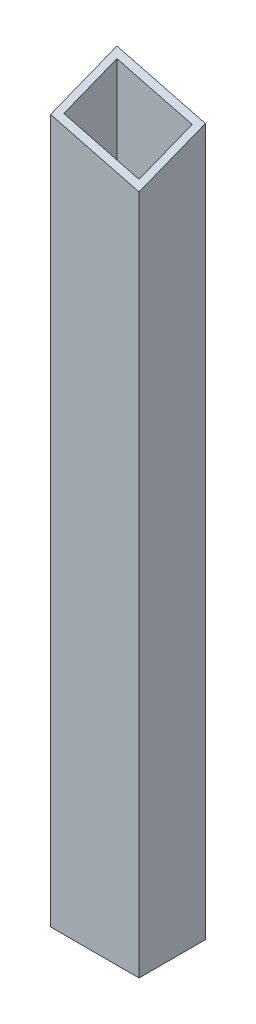
ISO-10303-21;
HEADER;
FILE_DESCRIPTION(('STEP AP214'),'2;1');
FILE_NAME('part.step','',(''),(''),'','','');
FILE_SCHEMA(('AUTOMOTIVE_DESIGN { 1 0 10303 214 1 1 1 1 }'));
ENDSEC;
DATA;
#1=APPLICATION_CONTEXT('core data for automotive mechanical design processes');
#2=APPLICATION_PROTOCOL_DEFINITION('international standard','automotive_design',2000,#1);
#3=PRODUCT_CONTEXT('',#1,'mechanical');
#4=PRODUCT('Part','Part','',(#3));
#5=PRODUCT_RELATED_PRODUCT_CATEGORY('part','',(#4));
#6=PRODUCT_DEFINITION_FORMATION('','',#4);
#7=PRODUCT_DEFINITION_CONTEXT('part definition',#1,'design');
#8=PRODUCT_DEFINITION('design','',#6,#7);
#9=PRODUCT_DEFINITION_SHAPE('','',#8);
#10=(LENGTH_UNIT() NAMED_UNIT(*) SI_UNIT(.MILLI.,.METRE.));
#11=(NAMED_UNIT(*) PLANE_ANGLE_UNIT() SI_UNIT($,.RADIAN.));
#12=(NAMED_UNIT(*) SI_UNIT($,.STERADIAN.) SOLID_ANGLE_UNIT());
#13=UNCERTAINTY_MEASURE_WITH_UNIT(LENGTH_MEASURE(1.E-05),#10,'distance_accuracy_value','');
#14=(GEOMETRIC_REPRESENTATION_CONTEXT(3) GLOBAL_UNCERTAINTY_ASSIGNED_CONTEXT((#13)) GLOBAL_UNIT_ASSIGNED_CONTEXT((#10,
#11,#12)) REPRESENTATION_CONTEXT('',''));
#15=CARTESIAN_POINT('',(0.,0.,0.));
#16=DIRECTION('',(0.,0.,1.));
#17=DIRECTION('',(1.,0.,0.));
#18=AXIS2_PLACEMENT_3D('',#15,#16,#17);
#19=CARTESIAN_POINT('',(0.,0.,0.));
#20=DIRECTION('',(0.,1.,0.));
#21=DIRECTION('',(0.,0.,1.));
#22=AXIS2_PLACEMENT_3D('',#19,#20,#21);
#23=PLANE('',#22);
#24=DIRECTION('',(0.,0.,1.));
#25=VECTOR('',#24,1.);
#26=CARTESIAN_POINT('',(-20.,0.,-15.));
#27=LINE('',#26,#25);
#28=CARTESIAN_POINT('',(-20.,0.,-15.));
#29=VERTEX_POINT('',#28);
#30=CARTESIAN_POINT('',(-20.,0.,15.));
#31=VERTEX_POINT('',#30);
#32=EDGE_CURVE('E156',#29,#31,#27,.T.);
#33=ORIENTED_EDGE('',*,*,#32,.F.);
#34=DIRECTION('',(-1.,0.,0.));
#35=VECTOR('',#34,1.);
#36=CARTESIAN_POINT('',(20.,0.,-15.));
#37=LINE('',#36,#35);
#38=CARTESIAN_POINT('',(20.,0.,-15.));
#39=VERTEX_POINT('',#38);
#40=EDGE_CURVE('E148',#39,#29,#37,.T.);
#41=ORIENTED_EDGE('',*,*,#40,.F.);
#42=DIRECTION('',(0.,0.,-1.));
#43=VECTOR('',#42,1.);
#44=CARTESIAN_POINT('',(20.,0.,-15.));
#45=LINE('',#44,#43);
#46=CARTESIAN_POINT('',(20.,0.,15.));
#47=VERTEX_POINT('',#46);
#48=EDGE_CURVE('E145',#47,#39,#45,.T.);
#49=ORIENTED_EDGE('',*,*,#48,.F.);
#50=DIRECTION('',(1.,0.,0.));
#51=VECTOR('',#50,1.);
#52=CARTESIAN_POINT('',(20.,0.,15.));
#53=LINE('',#52,#51);
#54=EDGE_CURVE('E153',#31,#47,#53,.T.);
#55=ORIENTED_EDGE('',*,*,#54,.F.);
#56=EDGE_LOOP('',(#33,#41,#49,#55));
#57=FACE_BOUND('',#56,.T.);
#58=DIRECTION('',(0.,0.,1.));
#59=VECTOR('',#58,1.);
#60=CARTESIAN_POINT('',(-17.,0.,0.));
#61=LINE('',#60,#59);
#62=CARTESIAN_POINT('',(-17.,0.,-12.));
#63=VERTEX_POINT('',#62);
#64=CARTESIAN_POINT('',(-17.,0.,12.));
#65=VERTEX_POINT('',#64);
#66=EDGE_CURVE('E175',#63,#65,#61,.T.);
#67=ORIENTED_EDGE('',*,*,#66,.T.);
#68=DIRECTION('',(1.,0.,0.));
#69=VECTOR('',#68,1.);
#70=CARTESIAN_POINT('',(0.,0.,12.));
#71=LINE('',#70,#69);
#72=CARTESIAN_POINT('',(17.,0.,12.));
#73=VERTEX_POINT('',#72);
#74=EDGE_CURVE('E172',#65,#73,#71,.T.);
#75=ORIENTED_EDGE('',*,*,#74,.T.);
#76=DIRECTION('',(0.,0.,-1.));
#77=VECTOR('',#76,1.);
#78=CARTESIAN_POINT('',(17.,0.,0.));
#79=LINE('',#78,#77);
#80=CARTESIAN_POINT('',(17.,0.,-12.));
#81=VERTEX_POINT('',#80);
#82=EDGE_CURVE('E169',#73,#81,#79,.T.);
#83=ORIENTED_EDGE('',*,*,#82,.T.);
#84=DIRECTION('',(-1.,0.,0.));
#85=VECTOR('',#84,1.);
#86=CARTESIAN_POINT('',(0.,0.,-12.));
#87=LINE('',#86,#85);
#88=EDGE_CURVE('E166',#81,#63,#87,.T.);
#89=ORIENTED_EDGE('',*,*,#88,.T.);
#90=EDGE_LOOP('',(#67,#75,#83,#89));
#91=FACE_BOUND('',#90,.T.);
#92=ADVANCED_FACE('F59',(#57,#91),#23,.F.);
#93=CARTESIAN_POINT('',(-20.,330.,-15.));
#94=DIRECTION('',(1.,0.,0.));
#95=DIRECTION('',(0.,0.,-1.));
#96=AXIS2_PLACEMENT_3D('',#93,#94,#95);
#97=PLANE('',#96);
#98=DIRECTION('',(0.,-1.,0.));
#99=VECTOR('',#98,1.);
#100=CARTESIAN_POINT('',(-20.,330.,15.));
#101=LINE('',#100,#99);
#102=CARTESIAN_POINT('',(-20.,318.182685731552,15.));
#103=VERTEX_POINT('',#102);
#104=EDGE_CURVE('E12',#103,#31,#101,.T.);
#105=ORIENTED_EDGE('',*,*,#104,.F.);
#106=DIRECTION('',(0.,-0.366501226724301,0.930417567982023));
#107=VECTOR('',#106,1.);
#108=CARTESIAN_POINT('',(-20.,318.182685731552,15.));
#109=LINE('',#108,#107);
#110=CARTESIAN_POINT('',(-20.,330.,-15.));
#111=VERTEX_POINT('',#110);
#112=EDGE_CURVE('E178',#111,#103,#109,.T.);
#113=ORIENTED_EDGE('',*,*,#112,.F.);
#114=DIRECTION('',(0.,-1.,0.));
#115=VECTOR('',#114,1.);
#116=CARTESIAN_POINT('',(-20.,330.,-15.));
#117=LINE('',#116,#115);
#118=EDGE_CURVE('E141',#111,#29,#117,.T.);
#119=ORIENTED_EDGE('',*,*,#118,.T.);
#120=ORIENTED_EDGE('',*,*,#32,.T.);
#121=EDGE_LOOP('',(#105,#113,#119,#120));
#122=FACE_BOUND('',#121,.T.);
#123=ADVANCED_FACE('F61',(#122),#97,.F.);
#124=CARTESIAN_POINT('',(20.,330.,15.));
#125=DIRECTION('',(0.,0.,-1.));
#126=DIRECTION('',(-1.,0.,0.));
#127=AXIS2_PLACEMENT_3D('',#124,#125,#126);
#128=PLANE('',#127);
#129=DIRECTION('',(0.,-1.,0.));
#130=VECTOR('',#129,1.);
#131=CARTESIAN_POINT('',(20.,330.,15.));
#132=LINE('',#131,#130);
#133=CARTESIAN_POINT('',(20.,307.837982357316,15.));
#134=VERTEX_POINT('',#133);
#135=EDGE_CURVE('E67',#134,#47,#132,.T.);
#136=ORIENTED_EDGE('',*,*,#135,.F.);
#137=DIRECTION('',(-0.968147640378107,0.250380004054445,0.));
#138=VECTOR('',#137,1.);
#139=CARTESIAN_POINT('',(14.6278203213788,309.227322488527,15.));
#140=LINE('',#139,#138);
#141=EDGE_CURVE('E129',#134,#103,#140,.T.);
#142=ORIENTED_EDGE('',*,*,#141,.T.);
#143=ORIENTED_EDGE('',*,*,#104,.T.);
#144=ORIENTED_EDGE('',*,*,#54,.T.);
#145=EDGE_LOOP('',(#136,#142,#143,#144));
#146=FACE_BOUND('',#145,.T.);
#147=ADVANCED_FACE('F215',(#146),#128,.F.);
#148=CARTESIAN_POINT('',(20.,330.,-15.));
#149=DIRECTION('',(-1.,0.,0.));
#150=DIRECTION('',(0.,0.,1.));
#151=AXIS2_PLACEMENT_3D('',#148,#149,#150);
#152=PLANE('',#151);
#153=DIRECTION('',(0.,-1.,0.));
#154=VECTOR('',#153,1.);
#155=CARTESIAN_POINT('',(20.,330.,-15.));
#156=LINE('',#155,#154);
#157=CARTESIAN_POINT('',(20.,319.655296625764,-15.));
#158=VERTEX_POINT('',#157);
#159=EDGE_CURVE('E138',#158,#39,#156,.T.);
#160=ORIENTED_EDGE('',*,*,#159,.F.);
#161=DIRECTION('',(0.,0.366501226724301,-0.930417567982023));
#162=VECTOR('',#161,1.);
#163=CARTESIAN_POINT('',(20.,265.098681991989,123.500034934601));
#164=LINE('',#163,#162);
#165=EDGE_CURVE('E123',#134,#158,#164,.T.);
#166=ORIENTED_EDGE('',*,*,#165,.F.);
#167=ORIENTED_EDGE('',*,*,#135,.T.);
#168=ORIENTED_EDGE('',*,*,#48,.T.);
#169=EDGE_LOOP('',(#160,#166,#167,#168));
#170=FACE_BOUND('',#169,.T.);
#171=ADVANCED_FACE('F143',(#170),#152,.F.);
#172=CARTESIAN_POINT('',(20.,330.,-15.));
#173=DIRECTION('',(0.,0.,1.));
#174=DIRECTION('',(1.,0.,0.));
#175=AXIS2_PLACEMENT_3D('',#172,#173,#174);
#176=PLANE('',#175);
#177=ORIENTED_EDGE('',*,*,#118,.F.);
#178=DIRECTION('',(-0.968147640378107,0.250380004054445,0.));
#179=VECTOR('',#178,1.);
#180=CARTESIAN_POINT('',(20.,319.655296625764,-15.));
#181=LINE('',#180,#179);
#182=EDGE_CURVE('E126',#158,#111,#181,.T.);
#183=ORIENTED_EDGE('',*,*,#182,.F.);
#184=ORIENTED_EDGE('',*,*,#159,.T.);
#185=ORIENTED_EDGE('',*,*,#40,.T.);
#186=EDGE_LOOP('',(#177,#183,#184,#185));
#187=FACE_BOUND('',#186,.T.);
#188=ADVANCED_FACE('F137',(#187),#176,.F.);
#189=CARTESIAN_POINT('',(-17.,330.,0.));
#190=DIRECTION('',(1.,0.,0.));
#191=DIRECTION('',(0.,0.,-1.));
#192=AXIS2_PLACEMENT_3D('',#189,#190,#191);
#193=PLANE('',#192);
#194=DIRECTION('',(0.,0.366501226724301,-0.930417567982023));
#195=VECTOR('',#194,1.);
#196=CARTESIAN_POINT('',(-17.,324.213374531564,-2.27941239047733));
#197=LINE('',#196,#195);
#198=CARTESIAN_POINT('',(-17.,318.588564405329,12.));
#199=VERTEX_POINT('',#198);
#200=CARTESIAN_POINT('',(-17.,328.042415820087,-12.));
#201=VERTEX_POINT('',#200);
#202=EDGE_CURVE('E74',#199,#201,#197,.T.);
#203=ORIENTED_EDGE('',*,*,#202,.F.);
#204=DIRECTION('',(0.,-1.,0.));
#205=VECTOR('',#204,1.);
#206=CARTESIAN_POINT('',(-17.,330.,12.));
#207=LINE('',#206,#205);
#208=EDGE_CURVE('E159',#199,#65,#207,.T.);
#209=ORIENTED_EDGE('',*,*,#208,.T.);
#210=ORIENTED_EDGE('',*,*,#66,.F.);
#211=DIRECTION('',(0.,-1.,0.));
#212=VECTOR('',#211,1.);
#213=CARTESIAN_POINT('',(-17.,330.,-12.));
#214=LINE('',#213,#212);
#215=EDGE_CURVE('E81',#201,#63,#214,.T.);
#216=ORIENTED_EDGE('',*,*,#215,.F.);
#217=EDGE_LOOP('',(#203,#209,#210,#216));
#218=FACE_BOUND('',#217,.T.);
#219=ADVANCED_FACE('F200',(#218),#193,.T.);
#220=CARTESIAN_POINT('',(0.,330.,12.));
#221=DIRECTION('',(0.,0.,-1.));
#222=DIRECTION('',(-1.,0.,0.));
#223=AXIS2_PLACEMENT_3D('',#220,#221,#222);
#224=PLANE('',#223);
#225=DIRECTION('',(-0.968147640378107,0.250380004054445,0.));
#226=VECTOR('',#225,1.);
#227=CARTESIAN_POINT('',(-3.83191936787425,315.183067201645,12.));
#228=LINE('',#227,#226);
#229=CARTESIAN_POINT('',(17.,309.795566537228,12.));
#230=VERTEX_POINT('',#229);
#231=EDGE_CURVE('E182',#230,#199,#228,.T.);
#232=ORIENTED_EDGE('',*,*,#231,.F.);
#233=DIRECTION('',(0.,-1.,0.));
#234=VECTOR('',#233,1.);
#235=CARTESIAN_POINT('',(17.,330.,12.));
#236=LINE('',#235,#234);
#237=EDGE_CURVE('E161',#230,#73,#236,.T.);
#238=ORIENTED_EDGE('',*,*,#237,.T.);
#239=ORIENTED_EDGE('',*,*,#74,.F.);
#240=ORIENTED_EDGE('',*,*,#208,.F.);
#241=EDGE_LOOP('',(#232,#238,#239,#240));
#242=FACE_BOUND('',#241,.T.);
#243=ADVANCED_FACE('F198',(#242),#224,.T.);
#244=CARTESIAN_POINT('',(17.,330.,0.));
#245=DIRECTION('',(-1.,0.,0.));
#246=DIRECTION('',(0.,0.,1.));
#247=AXIS2_PLACEMENT_3D('',#244,#245,#246);
#248=PLANE('',#247);
#249=DIRECTION('',(0.,-0.366501226724301,0.930417567982023));
#250=VECTOR('',#249,1.);
#251=CARTESIAN_POINT('',(17.,316.601479827931,-5.27781745351612));
#252=LINE('',#251,#250);
#253=CARTESIAN_POINT('',(17.,319.249417951987,-12.));
#254=VERTEX_POINT('',#253);
#255=EDGE_CURVE('E184',#254,#230,#252,.T.);
#256=ORIENTED_EDGE('',*,*,#255,.F.);
#257=DIRECTION('',(0.,-1.,0.));
#258=VECTOR('',#257,1.);
#259=CARTESIAN_POINT('',(17.,330.,-12.));
#260=LINE('',#259,#258);
#261=EDGE_CURVE('E163',#254,#81,#260,.T.);
#262=ORIENTED_EDGE('',*,*,#261,.T.);
#263=ORIENTED_EDGE('',*,*,#82,.F.);
#264=ORIENTED_EDGE('',*,*,#237,.F.);
#265=EDGE_LOOP('',(#256,#262,#263,#264));
#266=FACE_BOUND('',#265,.T.);
#267=ADVANCED_FACE('F191',(#266),#248,.T.);
#268=CARTESIAN_POINT('',(0.,330.,-12.));
#269=DIRECTION('',(0.,0.,1.));
#270=DIRECTION('',(1.,0.,0.));
#271=AXIS2_PLACEMENT_3D('',#268,#269,#270);
#272=PLANE('',#271);
#273=DIRECTION('',(0.968147640378107,-0.250380004054445,0.));
#274=VECTOR('',#273,1.);
#275=CARTESIAN_POINT('',(-1.54026031074699,324.044255286882,-12.));
#276=LINE('',#275,#274);
#277=EDGE_CURVE('E133',#201,#254,#276,.T.);
#278=ORIENTED_EDGE('',*,*,#277,.F.);
#279=ORIENTED_EDGE('',*,*,#215,.T.);
#280=ORIENTED_EDGE('',*,*,#88,.F.);
#281=ORIENTED_EDGE('',*,*,#261,.F.);
#282=EDGE_LOOP('',(#278,#279,#280,#281));
#283=FACE_BOUND('',#282,.T.);
#284=ADVANCED_FACE('F193',(#283),#272,.T.);
#285=CARTESIAN_POINT('',(20.,265.098681991989,123.500034934601));
#286=DIRECTION('',(-0.233945031713017,-0.904598317611209,-0.356330753530712));
#287=DIRECTION('',(0.,0.366501226724301,-0.930417567982023));
#288=AXIS2_PLACEMENT_3D('',#285,#286,#287);
#289=PLANE('',#288);
#290=ORIENTED_EDGE('',*,*,#202,.T.);
#291=ORIENTED_EDGE('',*,*,#277,.T.);
#292=ORIENTED_EDGE('',*,*,#255,.T.);
#293=ORIENTED_EDGE('',*,*,#231,.T.);
#294=EDGE_LOOP('',(#290,#291,#292,#293));
#295=FACE_BOUND('',#294,.T.);
#296=ORIENTED_EDGE('',*,*,#165,.T.);
#297=ORIENTED_EDGE('',*,*,#182,.T.);
#298=ORIENTED_EDGE('',*,*,#112,.T.);
#299=ORIENTED_EDGE('',*,*,#141,.F.);
#300=EDGE_LOOP('',(#296,#297,#298,#299));
#301=FACE_BOUND('',#300,.T.);
#302=ADVANCED_FACE('F125',(#295,#301),#289,.F.);
#303=CLOSED_SHELL('',(#92,#123,#147,#171,#188,#219,#243,#267,#284,#302));
#304=MANIFOLD_SOLID_BREP('B2',#303);
#305=ADVANCED_BREP_SHAPE_REPRESENTATION('',(#18,#304),#14);
#306=SHAPE_DEFINITION_REPRESENTATION(#9,#305);
ENDSEC;
END-ISO-10303-21;
